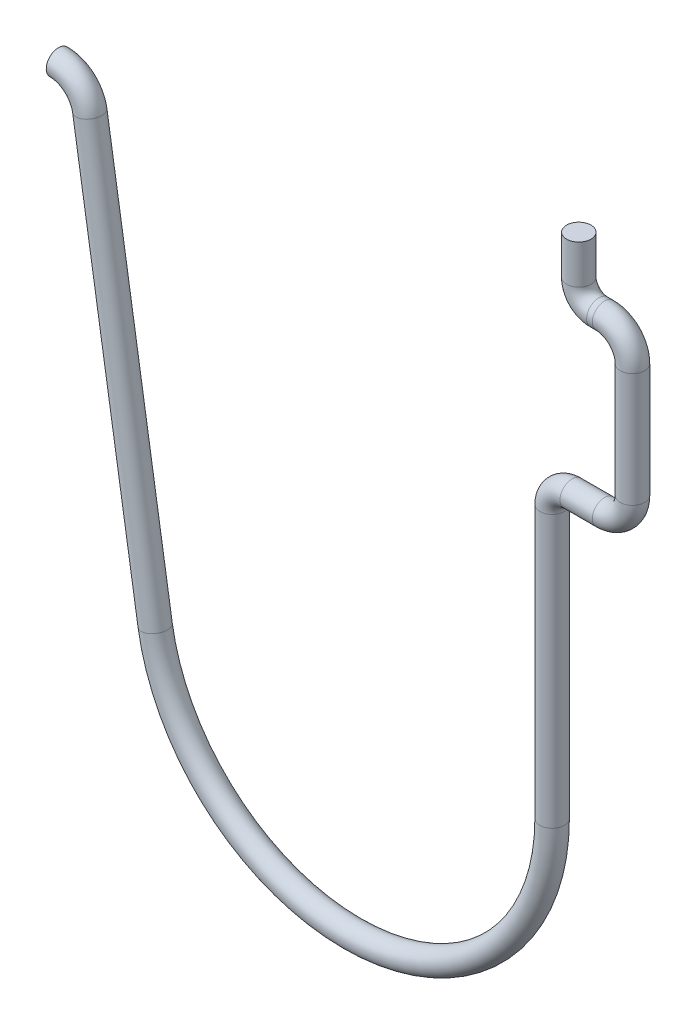
ISO-10303-21;
HEADER;
FILE_DESCRIPTION(('STEP AP214'),'2;1');
FILE_NAME('part.step','',(''),(''),'','','');
FILE_SCHEMA(('AUTOMOTIVE_DESIGN { 1 0 10303 214 1 1 1 1 }'));
ENDSEC;
DATA;
#1=APPLICATION_CONTEXT('core data for automotive mechanical design processes');
#2=APPLICATION_PROTOCOL_DEFINITION('international standard','automotive_design',2000,#1);
#3=PRODUCT_CONTEXT('',#1,'mechanical');
#4=PRODUCT('Part','Part','',(#3));
#5=PRODUCT_RELATED_PRODUCT_CATEGORY('part','',(#4));
#6=PRODUCT_DEFINITION_FORMATION('','',#4);
#7=PRODUCT_DEFINITION_CONTEXT('part definition',#1,'design');
#8=PRODUCT_DEFINITION('design','',#6,#7);
#9=PRODUCT_DEFINITION_SHAPE('','',#8);
#10=(LENGTH_UNIT() NAMED_UNIT(*) SI_UNIT(.MILLI.,.METRE.));
#11=(NAMED_UNIT(*) PLANE_ANGLE_UNIT() SI_UNIT($,.RADIAN.));
#12=(NAMED_UNIT(*) SI_UNIT($,.STERADIAN.) SOLID_ANGLE_UNIT());
#13=UNCERTAINTY_MEASURE_WITH_UNIT(LENGTH_MEASURE(1.E-05),#10,'distance_accuracy_value','');
#14=(GEOMETRIC_REPRESENTATION_CONTEXT(3) GLOBAL_UNCERTAINTY_ASSIGNED_CONTEXT((#13)) GLOBAL_UNIT_ASSIGNED_CONTEXT((#10,
#11,#12)) REPRESENTATION_CONTEXT('',''));
#15=CARTESIAN_POINT('',(0.,0.,0.));
#16=DIRECTION('',(0.,0.,1.));
#17=DIRECTION('',(1.,0.,0.));
#18=AXIS2_PLACEMENT_3D('',#15,#16,#17);
#19=CARTESIAN_POINT('',(-33.8325097315456,-9.38729427085146,0.));
#20=DIRECTION('',(0.,0.,1.));
#21=DIRECTION('',(1.,0.,0.));
#22=AXIS2_PLACEMENT_3D('',#19,#20,#21);
#23=TOROIDAL_SURFACE('',#22,2.06374999999998,0.79375);
#24=CARTESIAN_POINT('',(-31.7941679186424,-9.0644526436247,0.));
#25=DIRECTION('',(0.156434465040192,-0.987688340595144,0.));
#26=DIRECTION('',(0.,0.,1.));
#27=AXIS2_PLACEMENT_3D('',#24,#25,#26);
#28=CIRCLE('',#27,0.79375);
#29=CARTESIAN_POINT('',(-31.010190298295,-8.94028278699902,0.));
#30=VERTEX_POINT('',#29);
#31=EDGE_CURVE('E43',#30,#30,#28,.T.);
#32=CARTESIAN_POINT('',(-33.8325097315456,-7.32354427085148,0.));
#33=DIRECTION('',(1.,0.,0.));
#34=DIRECTION('',(0.,0.,1.));
#35=AXIS2_PLACEMENT_3D('',#32,#33,#34);
#36=CIRCLE('',#35,0.79375);
#37=CARTESIAN_POINT('',(-33.8325097315456,-6.52979427085148,0.));
#38=VERTEX_POINT('',#37);
#39=EDGE_CURVE('E10',#38,#38,#36,.T.);
#40=CARTESIAN_POINT('',(-33.8325097315456,-9.38729427085146,0.));
#41=DIRECTION('',(0.,0.,1.));
#42=DIRECTION('',(1.,0.,0.));
#43=AXIS2_PLACEMENT_3D('',#40,#41,#42);
#44=CIRCLE('',#43,2.85749999999998);
#45=EDGE_CURVE('',#30,#38,#44,.T.);
#46=ORIENTED_EDGE('',*,*,#31,.F.);
#47=ORIENTED_EDGE('',*,*,#39,.T.);
#48=ORIENTED_EDGE('',*,*,#45,.T.);
#49=ORIENTED_EDGE('',*,*,#45,.F.);
#50=EDGE_LOOP('',(#46,#48,#47,#49));
#51=FACE_BOUND('',#50,.T.);
#52=ADVANCED_FACE('F36',(#51),#23,.T.);
#53=CARTESIAN_POINT('',(-27.5425920277792,-35.9078463643194,0.));
#54=DIRECTION('',(-0.156434465040224,0.987688340595139,0.));
#55=DIRECTION('',(-0.987688340595139,-0.156434465040224,0.));
#56=AXIS2_PLACEMENT_3D('',#53,#54,#55);
#57=CYLINDRICAL_SURFACE('',#56,0.79375);
#58=CARTESIAN_POINT('',(-27.5425920277792,-35.9078463643194,0.));
#59=DIRECTION('',(0.156434465040192,-0.987688340595144,0.));
#60=DIRECTION('',(0.,0.,1.));
#61=AXIS2_PLACEMENT_3D('',#58,#59,#60);
#62=CIRCLE('',#61,0.79375);
#63=CARTESIAN_POINT('',(-28.3265696481266,-36.0320162209451,0.));
#64=VERTEX_POINT('',#63);
#65=EDGE_CURVE('E49',#64,#64,#62,.T.);
#66=ORIENTED_EDGE('',*,*,#65,.F.);
#67=EDGE_LOOP('',(#66));
#68=FACE_BOUND('',#67,.T.);
#69=ORIENTED_EDGE('',*,*,#31,.T.);
#70=EDGE_LOOP('',(#69));
#71=FACE_BOUND('',#70,.T.);
#72=ADVANCED_FACE('F114',(#68,#71),#57,.T.);
#73=CARTESIAN_POINT('',(-14.717800892,-33.876598998,0.));
#74=DIRECTION('',(0.,0.,-1.));
#75=DIRECTION('',(-1.,0.,0.));
#76=AXIS2_PLACEMENT_3D('',#73,#74,#75);
#77=TOROIDAL_SURFACE('',#76,12.9846537704915,0.79375);
#78=CARTESIAN_POINT('',(-1.73314712150844,-33.876598998,0.));
#79=DIRECTION('',(0.,1.,0.));
#80=DIRECTION('',(0.,0.,1.));
#81=AXIS2_PLACEMENT_3D('',#78,#79,#80);
#82=CIRCLE('',#81,0.79375);
#83=CARTESIAN_POINT('',(-0.939397121508444,-33.876598998,0.));
#84=VERTEX_POINT('',#83);
#85=EDGE_CURVE('E55',#84,#84,#82,.T.);
#86=CARTESIAN_POINT('',(-14.717800892,-33.876598998,0.));
#87=DIRECTION('',(0.,0.,-1.));
#88=DIRECTION('',(-1.,0.,0.));
#89=AXIS2_PLACEMENT_3D('',#86,#87,#88);
#90=CIRCLE('',#89,13.7784037704915);
#91=EDGE_CURVE('',#84,#64,#90,.T.);
#92=ORIENTED_EDGE('',*,*,#85,.F.);
#93=ORIENTED_EDGE('',*,*,#65,.T.);
#94=ORIENTED_EDGE('',*,*,#91,.T.);
#95=ORIENTED_EDGE('',*,*,#91,.F.);
#96=EDGE_LOOP('',(#92,#94,#93,#95));
#97=FACE_BOUND('',#96,.T.);
#98=ADVANCED_FACE('F119',(#97),#77,.T.);
#99=CARTESIAN_POINT('',(-1.73314712150844,-16.2051999999999,0.));
#100=DIRECTION('',(0.,-1.,0.));
#101=DIRECTION('',(1.,0.,0.));
#102=AXIS2_PLACEMENT_3D('',#99,#100,#101);
#103=CYLINDRICAL_SURFACE('',#102,0.79375);
#104=CARTESIAN_POINT('',(-1.73314712150844,-16.2051999999999,0.));
#105=DIRECTION('',(0.,1.,0.));
#106=DIRECTION('',(0.,0.,1.));
#107=AXIS2_PLACEMENT_3D('',#104,#105,#106);
#108=CIRCLE('',#107,0.79375);
#109=CARTESIAN_POINT('',(-2.52689712150844,-16.2051999999999,0.));
#110=VERTEX_POINT('',#109);
#111=EDGE_CURVE('E61',#110,#110,#108,.T.);
#112=ORIENTED_EDGE('',*,*,#111,.F.);
#113=EDGE_LOOP('',(#112));
#114=FACE_BOUND('',#113,.T.);
#115=ORIENTED_EDGE('',*,*,#85,.T.);
#116=EDGE_LOOP('',(#115));
#117=FACE_BOUND('',#116,.T.);
#118=ADVANCED_FACE('F124',(#114,#117),#103,.T.);
#119=CARTESIAN_POINT('',(-0.431397121508412,-16.2051999999999,0.));
#120=DIRECTION('',(0.,0.,1.));
#121=DIRECTION('',(1.,0.,0.));
#122=AXIS2_PLACEMENT_3D('',#119,#120,#121);
#123=TOROIDAL_SURFACE('',#122,1.30175000000003,0.79375);
#124=CARTESIAN_POINT('',(-0.431397121508316,-14.9034499999999,0.));
#125=DIRECTION('',(1.,-1.06298133419133E-13,0.));
#126=DIRECTION('',(0.,0.,1.));
#127=AXIS2_PLACEMENT_3D('',#124,#125,#126);
#128=CIRCLE('',#127,0.79375);
#129=CARTESIAN_POINT('',(-0.431397121508257,-14.1096999999999,0.));
#130=VERTEX_POINT('',#129);
#131=EDGE_CURVE('E64',#130,#130,#128,.T.);
#132=CARTESIAN_POINT('',(-0.431397121508412,-16.2051999999999,0.));
#133=DIRECTION('',(0.,0.,1.));
#134=DIRECTION('',(1.,0.,0.));
#135=AXIS2_PLACEMENT_3D('',#132,#133,#134);
#136=CIRCLE('',#135,2.09550000000003);
#137=EDGE_CURVE('',#130,#110,#136,.T.);
#138=ORIENTED_EDGE('',*,*,#131,.F.);
#139=ORIENTED_EDGE('',*,*,#111,.T.);
#140=ORIENTED_EDGE('',*,*,#137,.T.);
#141=ORIENTED_EDGE('',*,*,#137,.F.);
#142=EDGE_LOOP('',(#138,#140,#139,#141));
#143=FACE_BOUND('',#142,.T.);
#144=ADVANCED_FACE('F131',(#143),#123,.T.);
#145=CARTESIAN_POINT('',(1.67004999999989,-14.90345,0.));
#146=DIRECTION('',(-1.,0.,0.));
#147=DIRECTION('',(0.,-1.,0.));
#148=AXIS2_PLACEMENT_3D('',#145,#146,#147);
#149=CYLINDRICAL_SURFACE('',#148,0.79375);
#150=CARTESIAN_POINT('',(1.67004999999989,-14.90345,0.));
#151=DIRECTION('',(1.,-1.06298133419133E-13,0.));
#152=DIRECTION('',(0.,0.,1.));
#153=AXIS2_PLACEMENT_3D('',#150,#151,#152);
#154=CIRCLE('',#153,0.79375);
#155=CARTESIAN_POINT('',(1.67004999999989,-15.6972,0.));
#156=VERTEX_POINT('',#155);
#157=EDGE_CURVE('E68',#156,#156,#154,.T.);
#158=ORIENTED_EDGE('',*,*,#157,.F.);
#159=EDGE_LOOP('',(#158));
#160=FACE_BOUND('',#159,.T.);
#161=ORIENTED_EDGE('',*,*,#131,.T.);
#162=EDGE_LOOP('',(#161));
#163=FACE_BOUND('',#162,.T.);
#164=ADVANCED_FACE('F135',(#160,#163),#149,.T.);
#165=CARTESIAN_POINT('',(1.6700499999999,-13.0810000000001,0.));
#166=DIRECTION('',(0.,0.,-1.));
#167=DIRECTION('',(-1.,0.,0.));
#168=AXIS2_PLACEMENT_3D('',#165,#166,#167);
#169=TOROIDAL_SURFACE('',#168,1.82244999999993,0.79375);
#170=CARTESIAN_POINT('',(3.49249999999983,-13.081,0.));
#171=DIRECTION('',(0.,1.,0.));
#172=DIRECTION('',(0.,0.,1.));
#173=AXIS2_PLACEMENT_3D('',#170,#171,#172);
#174=CIRCLE('',#173,0.79375);
#175=CARTESIAN_POINT('',(4.28624999999983,-13.081,0.));
#176=VERTEX_POINT('',#175);
#177=EDGE_CURVE('E72',#176,#176,#174,.T.);
#178=CARTESIAN_POINT('',(1.6700499999999,-13.0810000000001,0.));
#179=DIRECTION('',(0.,0.,-1.));
#180=DIRECTION('',(-1.,0.,0.));
#181=AXIS2_PLACEMENT_3D('',#178,#179,#180);
#182=CIRCLE('',#181,2.61619999999993);
#183=EDGE_CURVE('',#176,#156,#182,.T.);
#184=ORIENTED_EDGE('',*,*,#177,.F.);
#185=ORIENTED_EDGE('',*,*,#157,.T.);
#186=ORIENTED_EDGE('',*,*,#183,.T.);
#187=ORIENTED_EDGE('',*,*,#183,.F.);
#188=EDGE_LOOP('',(#184,#186,#185,#187));
#189=FACE_BOUND('',#188,.T.);
#190=ADVANCED_FACE('F139',(#189),#169,.T.);
#191=CARTESIAN_POINT('',(3.49249999999987,-5.66420000000005,0.));
#192=DIRECTION('',(0.,-1.,0.));
#193=DIRECTION('',(1.,0.,0.));
#194=AXIS2_PLACEMENT_3D('',#191,#192,#193);
#195=CYLINDRICAL_SURFACE('',#194,0.79375);
#196=CARTESIAN_POINT('',(3.49249999999987,-5.66420000000005,0.));
#197=DIRECTION('',(0.,1.,0.));
#198=DIRECTION('',(0.,0.,1.));
#199=AXIS2_PLACEMENT_3D('',#196,#197,#198);
#200=CIRCLE('',#199,0.79375);
#201=CARTESIAN_POINT('',(4.28624999999987,-5.6642000000001,0.));
#202=VERTEX_POINT('',#201);
#203=EDGE_CURVE('E76',#202,#202,#200,.T.);
#204=CARTESIAN_POINT('',(4.28624999999987,-5.6642000000001,0.));
#205=CARTESIAN_POINT('',(4.28624999999987,-5.74145833333344,0.));
#206=CARTESIAN_POINT('',(4.28624999999987,-5.81871666666677,0.));
#207=CARTESIAN_POINT('',(4.28624999999987,-5.97323333333344,0.));
#208=CARTESIAN_POINT('',(4.28624999999987,-6.05049166666677,0.));
#209=CARTESIAN_POINT('',(4.28624999999987,-6.20500833333343,0.));
#210=CARTESIAN_POINT('',(4.28624999999987,-6.28226666666677,0.));
#211=CARTESIAN_POINT('',(4.28624999999987,-6.43678333333343,0.));
#212=CARTESIAN_POINT('',(4.28624999999987,-6.51404166666677,0.));
#213=CARTESIAN_POINT('',(4.28624999999987,-6.66855833333343,0.));
#214=CARTESIAN_POINT('',(4.28624999999987,-6.74581666666676,0.));
#215=CARTESIAN_POINT('',(4.28624999999986,-6.90033333333343,0.));
#216=CARTESIAN_POINT('',(4.28624999999986,-6.97759166666676,0.));
#217=CARTESIAN_POINT('',(4.28624999999986,-7.13210833333343,0.));
#218=CARTESIAN_POINT('',(4.28624999999986,-7.20936666666676,0.));
#219=CARTESIAN_POINT('',(4.28624999999986,-7.36388333333343,0.));
#220=CARTESIAN_POINT('',(4.28624999999986,-7.44114166666676,0.));
#221=CARTESIAN_POINT('',(4.28624999999986,-7.59565833333343,0.));
#222=CARTESIAN_POINT('',(4.28624999999986,-7.67291666666676,0.));
#223=CARTESIAN_POINT('',(4.28624999999986,-7.82743333333342,0.));
#224=CARTESIAN_POINT('',(4.28624999999986,-7.90469166666676,0.));
#225=CARTESIAN_POINT('',(4.28624999999986,-8.05920833333342,0.));
#226=CARTESIAN_POINT('',(4.28624999999986,-8.13646666666675,0.));
#227=CARTESIAN_POINT('',(4.28624999999986,-8.29098333333342,0.));
#228=CARTESIAN_POINT('',(4.28624999999986,-8.36824166666675,0.));
#229=CARTESIAN_POINT('',(4.28624999999986,-8.52275833333342,0.));
#230=CARTESIAN_POINT('',(4.28624999999986,-8.60001666666675,0.));
#231=CARTESIAN_POINT('',(4.28624999999986,-8.75453333333342,0.));
#232=CARTESIAN_POINT('',(4.28624999999986,-8.83179166666675,0.));
#233=CARTESIAN_POINT('',(4.28624999999985,-8.98630833333342,0.));
#234=CARTESIAN_POINT('',(4.28624999999985,-9.06356666666675,0.));
#235=CARTESIAN_POINT('',(4.28624999999985,-9.21808333333342,0.));
#236=CARTESIAN_POINT('',(4.28624999999985,-9.29534166666675,0.));
#237=CARTESIAN_POINT('',(4.28624999999985,-9.44985833333341,0.));
#238=CARTESIAN_POINT('',(4.28624999999985,-9.52711666666675,0.));
#239=CARTESIAN_POINT('',(4.28624999999985,-9.68163333333341,0.));
#240=CARTESIAN_POINT('',(4.28624999999985,-9.75889166666675,0.));
#241=CARTESIAN_POINT('',(4.28624999999985,-9.91340833333341,0.));
#242=CARTESIAN_POINT('',(4.28624999999985,-9.99066666666674,0.));
#243=CARTESIAN_POINT('',(4.28624999999985,-10.1451833333334,0.));
#244=CARTESIAN_POINT('',(4.28624999999985,-10.2224416666667,0.));
#245=CARTESIAN_POINT('',(4.28624999999985,-10.3769583333334,0.));
#246=CARTESIAN_POINT('',(4.28624999999985,-10.4542166666667,0.));
#247=CARTESIAN_POINT('',(4.28624999999984,-10.6087333333334,0.));
#248=CARTESIAN_POINT('',(4.28624999999984,-10.6859916666667,0.));
#249=CARTESIAN_POINT('',(4.28624999999984,-10.8405083333334,0.));
#250=CARTESIAN_POINT('',(4.28624999999984,-10.9177666666667,0.));
#251=CARTESIAN_POINT('',(4.28624999999984,-11.0722833333334,0.));
#252=CARTESIAN_POINT('',(4.28624999999984,-11.1495416666667,0.));
#253=CARTESIAN_POINT('',(4.28624999999984,-11.3040583333334,0.));
#254=CARTESIAN_POINT('',(4.28624999999984,-11.3813166666667,0.));
#255=CARTESIAN_POINT('',(4.28624999999984,-11.5358333333334,0.));
#256=CARTESIAN_POINT('',(4.28624999999984,-11.6130916666667,0.));
#257=CARTESIAN_POINT('',(4.28624999999984,-11.7676083333334,0.));
#258=CARTESIAN_POINT('',(4.28624999999984,-11.8448666666667,0.));
#259=CARTESIAN_POINT('',(4.28624999999984,-11.9993833333334,0.));
#260=CARTESIAN_POINT('',(4.28624999999984,-12.0766416666667,0.));
#261=CARTESIAN_POINT('',(4.28624999999984,-12.2311583333334,0.));
#262=CARTESIAN_POINT('',(4.28624999999984,-12.3084166666667,0.));
#263=CARTESIAN_POINT('',(4.28624999999984,-12.4629333333334,0.));
#264=CARTESIAN_POINT('',(4.28624999999983,-12.5401916666667,0.));
#265=CARTESIAN_POINT('',(4.28624999999983,-12.6947083333334,0.));
#266=CARTESIAN_POINT('',(4.28624999999983,-12.7719666666667,0.));
#267=CARTESIAN_POINT('',(4.28624999999983,-12.9264833333334,0.));
#268=CARTESIAN_POINT('',(4.28624999999983,-13.0037416666667,0.));
#269=CARTESIAN_POINT('',(4.28624999999983,-13.0810000000001,0.));
#270=B_SPLINE_CURVE_WITH_KNOTS('',3,(#204,#205,#206,#207,#208,#209,#210,#211,#212,#213,#214,
#215,#216,#217,#218,#219,#220,#221,#222,#223,#224,#225,#226,#227,#228,#229,#230,#231,#232,#233,
#234,#235,#236,#237,#238,#239,#240,#241,#242,#243,#244,#245,#246,#247,#248,#249,#250,#251,#252,
#253,#254,#255,#256,#257,#258,#259,#260,#261,#262,#263,#264,#265,#266,#267,#268,#269),
.UNSPECIFIED.,.F.,.F.,(4,2,2,2,2,2,2,2,2,2,2,2,2,2,2,2,2,2,2,2,2,2,2,2,2,2,2,2,2,2,2,2,4),(0.,
0.231774999999998,0.463549999999997,0.695324999999996,0.927099999999994,1.15887499999999,
1.39064999999999,1.62242499999999,1.85419999999999,2.08597499999999,2.31774999999999,
2.54952499999998,2.78129999999998,3.01307499999998,3.24484999999998,3.47662499999998,
3.70839999999998,3.94017499999998,4.17194999999997,4.40372499999997,4.63549999999997,
4.86727499999997,5.09904999999997,5.33082499999997,5.56259999999997,5.79437499999996,
6.02614999999996,6.25792499999996,6.48969999999996,6.72147499999996,6.95324999999996,
7.18502499999996,7.41679999999995),.UNSPECIFIED.);
#271=EDGE_CURVE('BSEAM143',#202,#176,#270,.T.);
#272=ORIENTED_EDGE('',*,*,#203,.F.);
#273=ORIENTED_EDGE('',*,*,#177,.T.);
#274=ORIENTED_EDGE('',*,*,#271,.T.);
#275=ORIENTED_EDGE('',*,*,#271,.F.);
#276=EDGE_LOOP('',(#272,#274,#273,#275));
#277=FACE_BOUND('',#276,.T.);
#278=ADVANCED_FACE('F143',(#277),#195,.T.);
#279=CARTESIAN_POINT('',(1.67004999999997,-5.66419999999993,0.));
#280=DIRECTION('',(0.,0.,-1.));
#281=DIRECTION('',(-1.,0.,0.));
#282=AXIS2_PLACEMENT_3D('',#279,#280,#281);
#283=TOROIDAL_SURFACE('',#282,1.8224499999999,0.79375);
#284=CARTESIAN_POINT('',(1.67004999999997,-3.84175000000003,0.));
#285=DIRECTION('',(-1.,0.,0.));
#286=DIRECTION('',(0.,0.,1.));
#287=AXIS2_PLACEMENT_3D('',#284,#285,#286);
#288=CIRCLE('',#287,0.79375);
#289=CARTESIAN_POINT('',(1.67004999999997,-3.04800000000003,0.));
#290=VERTEX_POINT('',#289);
#291=EDGE_CURVE('E80',#290,#290,#288,.T.);
#292=CARTESIAN_POINT('',(1.67004999999997,-5.66419999999993,0.));
#293=DIRECTION('',(0.,0.,-1.));
#294=DIRECTION('',(-1.,0.,0.));
#295=AXIS2_PLACEMENT_3D('',#292,#293,#294);
#296=CIRCLE('',#295,2.6161999999999);
#297=EDGE_CURVE('',#290,#202,#296,.T.);
#298=ORIENTED_EDGE('',*,*,#291,.F.);
#299=ORIENTED_EDGE('',*,*,#203,.T.);
#300=ORIENTED_EDGE('',*,*,#297,.T.);
#301=ORIENTED_EDGE('',*,*,#297,.F.);
#302=EDGE_LOOP('',(#298,#300,#299,#301));
#303=FACE_BOUND('',#302,.T.);
#304=ADVANCED_FACE('F147',(#303),#283,.T.);
#305=CARTESIAN_POINT('',(1.30174999999999,-3.84175000000004,0.));
#306=DIRECTION('',(1.,0.,0.));
#307=DIRECTION('',(0.,1.,0.));
#308=AXIS2_PLACEMENT_3D('',#305,#306,#307);
#309=CYLINDRICAL_SURFACE('',#308,0.79375);
#310=CARTESIAN_POINT('',(1.30174999999999,-3.84175000000004,0.));
#311=DIRECTION('',(-1.,0.,0.));
#312=DIRECTION('',(0.,0.,1.));
#313=AXIS2_PLACEMENT_3D('',#310,#311,#312);
#314=CIRCLE('',#313,0.79375);
#315=CARTESIAN_POINT('',(1.30174999999999,-4.63550000000004,0.));
#316=VERTEX_POINT('',#315);
#317=EDGE_CURVE('E84',#316,#316,#314,.T.);
#318=ORIENTED_EDGE('',*,*,#317,.F.);
#319=EDGE_LOOP('',(#318));
#320=FACE_BOUND('',#319,.T.);
#321=ORIENTED_EDGE('',*,*,#291,.T.);
#322=EDGE_LOOP('',(#321));
#323=FACE_BOUND('',#322,.T.);
#324=ADVANCED_FACE('F110',(#320,#323),#309,.T.);
#325=CARTESIAN_POINT('',(1.30174999999999,-2.54000000000007,0.));
#326=DIRECTION('',(0.,0.,1.));
#327=DIRECTION('',(1.,0.,0.));
#328=AXIS2_PLACEMENT_3D('',#325,#326,#327);
#329=TOROIDAL_SURFACE('',#328,1.30174999999997,0.79375);
#330=CARTESIAN_POINT('',(0.,-2.54000000000007,0.));
#331=DIRECTION('',(0.,1.,0.));
#332=DIRECTION('',(0.,0.,1.));
#333=AXIS2_PLACEMENT_3D('',#330,#331,#332);
#334=CIRCLE('',#333,0.79375);
#335=CARTESIAN_POINT('',(-0.79374999999998,-2.54000000000007,0.));
#336=VERTEX_POINT('',#335);
#337=EDGE_CURVE('E88',#336,#336,#334,.T.);
#338=CARTESIAN_POINT('',(1.30174999999999,-2.54000000000007,0.));
#339=DIRECTION('',(0.,0.,1.));
#340=DIRECTION('',(1.,0.,0.));
#341=AXIS2_PLACEMENT_3D('',#338,#339,#340);
#342=CIRCLE('',#341,2.09549999999997);
#343=EDGE_CURVE('',#336,#316,#342,.T.);
#344=ORIENTED_EDGE('',*,*,#337,.F.);
#345=ORIENTED_EDGE('',*,*,#317,.T.);
#346=ORIENTED_EDGE('',*,*,#343,.T.);
#347=ORIENTED_EDGE('',*,*,#343,.F.);
#348=EDGE_LOOP('',(#344,#346,#345,#347));
#349=FACE_BOUND('',#348,.T.);
#350=ADVANCED_FACE('F101',(#349),#329,.T.);
#351=CARTESIAN_POINT('',(0.,-2.54000000000007,0.));
#352=DIRECTION('',(0.,1.,0.));
#353=DIRECTION('',(-1.,0.,0.));
#354=AXIS2_PLACEMENT_3D('',#351,#352,#353);
#355=CYLINDRICAL_SURFACE('',#354,0.79375);
#356=ORIENTED_EDGE('',*,*,#337,.T.);
#357=EDGE_LOOP('',(#356));
#358=FACE_BOUND('',#357,.T.);
#359=CARTESIAN_POINT('',(0.,0.,0.));
#360=DIRECTION('',(0.,1.,0.));
#361=DIRECTION('',(0.,0.,1.));
#362=AXIS2_PLACEMENT_3D('',#359,#360,#361);
#363=CIRCLE('',#362,0.79375);
#364=CARTESIAN_POINT('',(0.,0.,0.79375));
#365=VERTEX_POINT('',#364);
#366=EDGE_CURVE('E92',#365,#365,#363,.T.);
#367=ORIENTED_EDGE('',*,*,#366,.F.);
#368=EDGE_LOOP('',(#367));
#369=FACE_BOUND('',#368,.T.);
#370=ADVANCED_FACE('F98',(#358,#369),#355,.T.);
#371=CARTESIAN_POINT('',(-33.8325097315456,-7.32354427085148,0.));
#372=DIRECTION('',(1.,0.,0.));
#373=DIRECTION('',(0.,0.,1.));
#374=AXIS2_PLACEMENT_3D('',#371,#372,#373);
#375=PLANE('',#374);
#376=ORIENTED_EDGE('',*,*,#39,.F.);
#377=EDGE_LOOP('',(#376));
#378=FACE_BOUND('',#377,.T.);
#379=ADVANCED_FACE('F100',(#378),#375,.F.);
#380=CARTESIAN_POINT('',(0.,0.,0.));
#381=DIRECTION('',(0.,1.,0.));
#382=DIRECTION('',(0.,0.,1.));
#383=AXIS2_PLACEMENT_3D('',#380,#381,#382);
#384=PLANE('',#383);
#385=ORIENTED_EDGE('',*,*,#366,.T.);
#386=EDGE_LOOP('',(#385));
#387=FACE_BOUND('',#386,.T.);
#388=ADVANCED_FACE('F96',(#387),#384,.T.);
#389=CLOSED_SHELL('',(#52,#72,#98,#118,#144,#164,#190,#278,#304,#324,#350,#370,#379,#388));
#390=MANIFOLD_SOLID_BREP('B2',#389);
#391=ADVANCED_BREP_SHAPE_REPRESENTATION('',(#18,#390),#14);
#392=SHAPE_DEFINITION_REPRESENTATION(#9,#391);
ENDSEC;
END-ISO-10303-21;
